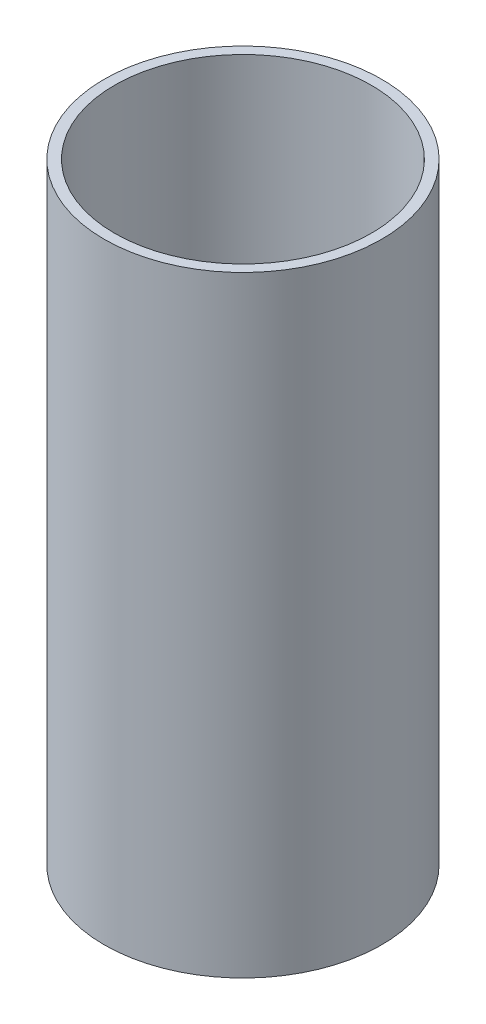
ISO-10303-21;
HEADER;
FILE_DESCRIPTION(('STEP AP214'),'2;1');
FILE_NAME('part.step','',(''),(''),'','','');
FILE_SCHEMA(('AUTOMOTIVE_DESIGN { 1 0 10303 214 1 1 1 1 }'));
ENDSEC;
DATA;
#1=APPLICATION_CONTEXT('core data for automotive mechanical design processes');
#2=APPLICATION_PROTOCOL_DEFINITION('international standard','automotive_design',2000,#1);
#3=PRODUCT_CONTEXT('',#1,'mechanical');
#4=PRODUCT('Part','Part','',(#3));
#5=PRODUCT_RELATED_PRODUCT_CATEGORY('part','',(#4));
#6=PRODUCT_DEFINITION_FORMATION('','',#4);
#7=PRODUCT_DEFINITION_CONTEXT('part definition',#1,'design');
#8=PRODUCT_DEFINITION('design','',#6,#7);
#9=PRODUCT_DEFINITION_SHAPE('','',#8);
#10=(LENGTH_UNIT() NAMED_UNIT(*) SI_UNIT(.MILLI.,.METRE.));
#11=(NAMED_UNIT(*) PLANE_ANGLE_UNIT() SI_UNIT($,.RADIAN.));
#12=(NAMED_UNIT(*) SI_UNIT($,.STERADIAN.) SOLID_ANGLE_UNIT());
#13=UNCERTAINTY_MEASURE_WITH_UNIT(LENGTH_MEASURE(1.E-05),#10,'distance_accuracy_value','');
#14=(GEOMETRIC_REPRESENTATION_CONTEXT(3) GLOBAL_UNCERTAINTY_ASSIGNED_CONTEXT((#13)) GLOBAL_UNIT_ASSIGNED_CONTEXT((#10,
#11,#12)) REPRESENTATION_CONTEXT('',''));
#15=CARTESIAN_POINT('',(0.,0.,0.));
#16=DIRECTION('',(0.,0.,1.));
#17=DIRECTION('',(1.,0.,0.));
#18=AXIS2_PLACEMENT_3D('',#15,#16,#17);
#19=CARTESIAN_POINT('',(0.,241.3,0.));
#20=DIRECTION('',(0.,1.,0.));
#21=DIRECTION('',(0.,0.,1.));
#22=AXIS2_PLACEMENT_3D('',#19,#20,#21);
#23=PLANE('',#22);
#24=CARTESIAN_POINT('',(0.,241.3,0.));
#25=DIRECTION('',(0.,1.,0.));
#26=DIRECTION('',(0.,0.,1.));
#27=AXIS2_PLACEMENT_3D('',#24,#25,#26);
#28=CIRCLE('',#27,109.5375);
#29=CARTESIAN_POINT('',(0.,241.3,109.5375));
#30=VERTEX_POINT('',#29);
#31=EDGE_CURVE('E10',#30,#30,#28,.T.);
#32=ORIENTED_EDGE('',*,*,#31,.T.);
#33=EDGE_LOOP('',(#32));
#34=FACE_BOUND('',#33,.T.);
#35=CARTESIAN_POINT('',(0.,241.3,0.));
#36=DIRECTION('',(0.,1.,0.));
#37=DIRECTION('',(0.,0.,1.));
#38=AXIS2_PLACEMENT_3D('',#35,#36,#37);
#39=CIRCLE('',#38,101.3587);
#40=CARTESIAN_POINT('',(0.,241.3,101.3587));
#41=VERTEX_POINT('',#40);
#42=EDGE_CURVE('E42',#41,#41,#39,.T.);
#43=ORIENTED_EDGE('',*,*,#42,.F.);
#44=EDGE_LOOP('',(#43));
#45=FACE_BOUND('',#44,.T.);
#46=ADVANCED_FACE('F31',(#34,#45),#23,.T.);
#47=CARTESIAN_POINT('',(0.,-241.3,0.));
#48=DIRECTION('',(0.,1.,0.));
#49=DIRECTION('',(0.,0.,1.));
#50=AXIS2_PLACEMENT_3D('',#47,#48,#49);
#51=PLANE('',#50);
#52=CARTESIAN_POINT('',(0.,-241.3,0.));
#53=DIRECTION('',(0.,1.,0.));
#54=DIRECTION('',(0.,0.,1.));
#55=AXIS2_PLACEMENT_3D('',#52,#53,#54);
#56=CIRCLE('',#55,109.5375);
#57=CARTESIAN_POINT('',(0.,-241.3,109.5375));
#58=VERTEX_POINT('',#57);
#59=EDGE_CURVE('E35',#58,#58,#56,.T.);
#60=ORIENTED_EDGE('',*,*,#59,.F.);
#61=EDGE_LOOP('',(#60));
#62=FACE_BOUND('',#61,.T.);
#63=CARTESIAN_POINT('',(0.,-241.3,0.));
#64=DIRECTION('',(0.,1.,0.));
#65=DIRECTION('',(0.,0.,1.));
#66=AXIS2_PLACEMENT_3D('',#63,#64,#65);
#67=CIRCLE('',#66,101.3587);
#68=CARTESIAN_POINT('',(0.,-241.3,101.3587));
#69=VERTEX_POINT('',#68);
#70=EDGE_CURVE('E44',#69,#69,#67,.T.);
#71=ORIENTED_EDGE('',*,*,#70,.T.);
#72=EDGE_LOOP('',(#71));
#73=FACE_BOUND('',#72,.T.);
#74=ADVANCED_FACE('F54',(#62,#73),#51,.F.);
#75=CARTESIAN_POINT('',(0.,241.3,0.));
#76=DIRECTION('',(0.,-1.,0.));
#77=DIRECTION('',(0.,0.,-1.));
#78=AXIS2_PLACEMENT_3D('',#75,#76,#77);
#79=CYLINDRICAL_SURFACE('',#78,109.5375);
#80=ORIENTED_EDGE('',*,*,#31,.F.);
#81=EDGE_LOOP('',(#80));
#82=FACE_BOUND('',#81,.T.);
#83=ORIENTED_EDGE('',*,*,#59,.T.);
#84=EDGE_LOOP('',(#83));
#85=FACE_BOUND('',#84,.T.);
#86=ADVANCED_FACE('F33',(#82,#85),#79,.T.);
#87=CARTESIAN_POINT('',(0.,241.3,0.));
#88=DIRECTION('',(0.,-1.,0.));
#89=DIRECTION('',(0.,0.,-1.));
#90=AXIS2_PLACEMENT_3D('',#87,#88,#89);
#91=CYLINDRICAL_SURFACE('',#90,101.3587);
#92=ORIENTED_EDGE('',*,*,#42,.T.);
#93=EDGE_LOOP('',(#92));
#94=FACE_BOUND('',#93,.T.);
#95=ORIENTED_EDGE('',*,*,#70,.F.);
#96=EDGE_LOOP('',(#95));
#97=FACE_BOUND('',#96,.T.);
#98=ADVANCED_FACE('F50',(#94,#97),#91,.F.);
#99=CLOSED_SHELL('',(#46,#74,#86,#98));
#100=MANIFOLD_SOLID_BREP('B2',#99);
#101=ADVANCED_BREP_SHAPE_REPRESENTATION('',(#18,#100),#14);
#102=SHAPE_DEFINITION_REPRESENTATION(#9,#101);
ENDSEC;
END-ISO-10303-21;
